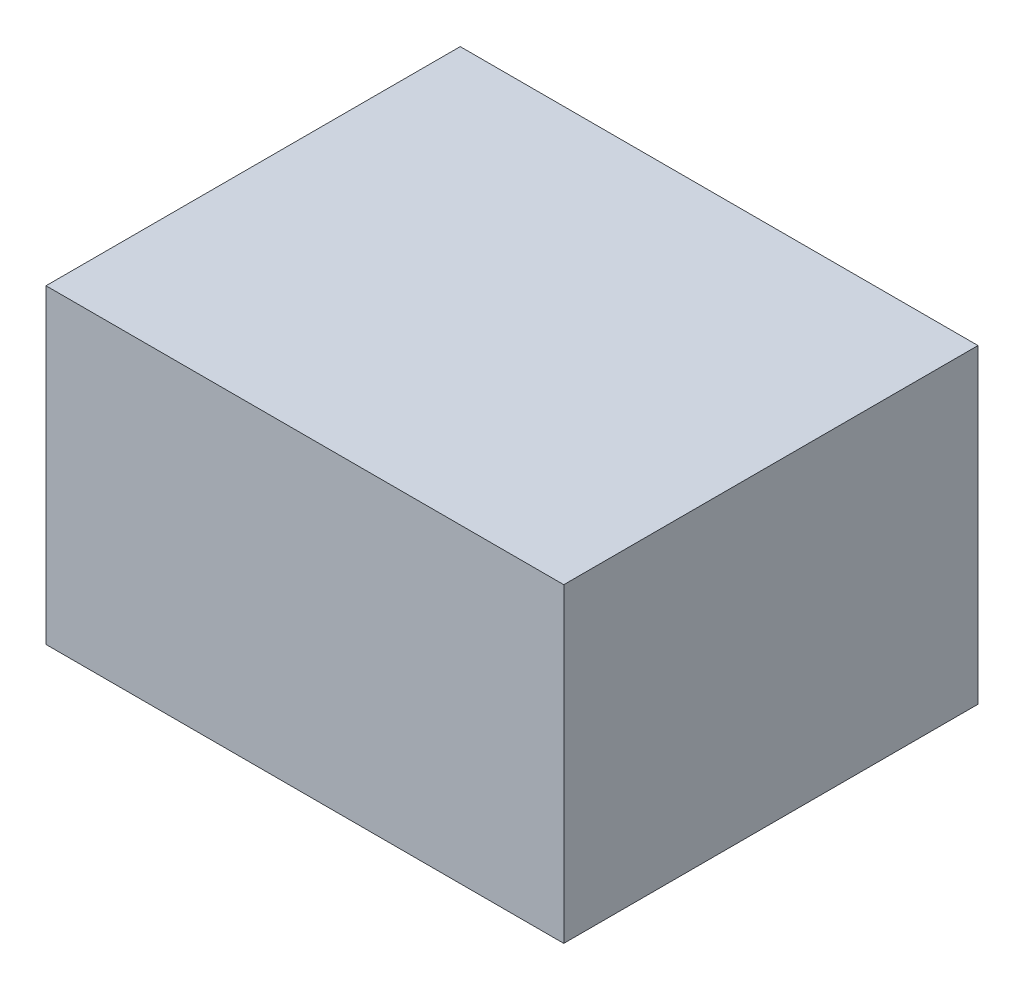
ISO-10303-21;
HEADER;
FILE_DESCRIPTION(('STEP AP214'),'2;1');
FILE_NAME('part.step','',(''),(''),'','','');
FILE_SCHEMA(('AUTOMOTIVE_DESIGN { 1 0 10303 214 1 1 1 1 }'));
ENDSEC;
DATA;
#1=APPLICATION_CONTEXT('core data for automotive mechanical design processes');
#2=APPLICATION_PROTOCOL_DEFINITION('international standard','automotive_design',2000,#1);
#3=PRODUCT_CONTEXT('',#1,'mechanical');
#4=PRODUCT('Part','Part','',(#3));
#5=PRODUCT_RELATED_PRODUCT_CATEGORY('part','',(#4));
#6=PRODUCT_DEFINITION_FORMATION('','',#4);
#7=PRODUCT_DEFINITION_CONTEXT('part definition',#1,'design');
#8=PRODUCT_DEFINITION('design','',#6,#7);
#9=PRODUCT_DEFINITION_SHAPE('','',#8);
#10=(LENGTH_UNIT() NAMED_UNIT(*) SI_UNIT(.MILLI.,.METRE.));
#11=(NAMED_UNIT(*) PLANE_ANGLE_UNIT() SI_UNIT($,.RADIAN.));
#12=(NAMED_UNIT(*) SI_UNIT($,.STERADIAN.) SOLID_ANGLE_UNIT());
#13=UNCERTAINTY_MEASURE_WITH_UNIT(LENGTH_MEASURE(1.E-05),#10,'distance_accuracy_value','');
#14=(GEOMETRIC_REPRESENTATION_CONTEXT(3) GLOBAL_UNCERTAINTY_ASSIGNED_CONTEXT((#13)) GLOBAL_UNIT_ASSIGNED_CONTEXT((#10,
#11,#12)) REPRESENTATION_CONTEXT('',''));
#15=CARTESIAN_POINT('',(0.,0.,0.));
#16=DIRECTION('',(0.,0.,1.));
#17=DIRECTION('',(1.,0.,0.));
#18=AXIS2_PLACEMENT_3D('',#15,#16,#17);
#19=CARTESIAN_POINT('',(127.,152.4,101.6));
#20=DIRECTION('',(-1.,0.,0.));
#21=DIRECTION('',(0.,0.,1.));
#22=AXIS2_PLACEMENT_3D('',#19,#20,#21);
#23=PLANE('',#22);
#24=DIRECTION('',(0.,0.,-1.));
#25=VECTOR('',#24,1.);
#26=CARTESIAN_POINT('',(127.,0.,101.6));
#27=LINE('',#26,#25);
#28=CARTESIAN_POINT('',(127.,0.,101.6));
#29=VERTEX_POINT('',#28);
#30=CARTESIAN_POINT('',(127.,0.,-101.6));
#31=VERTEX_POINT('',#30);
#32=EDGE_CURVE('E111',#29,#31,#27,.T.);
#33=ORIENTED_EDGE('',*,*,#32,.T.);
#34=DIRECTION('',(0.,-1.,0.));
#35=VECTOR('',#34,1.);
#36=CARTESIAN_POINT('',(127.,152.4,-101.6));
#37=LINE('',#36,#35);
#38=CARTESIAN_POINT('',(127.,152.4,-101.6));
#39=VERTEX_POINT('',#38);
#40=EDGE_CURVE('E11',#39,#31,#37,.T.);
#41=ORIENTED_EDGE('',*,*,#40,.F.);
#42=DIRECTION('',(0.,0.,-1.));
#43=VECTOR('',#42,1.);
#44=CARTESIAN_POINT('',(127.,152.4,101.6));
#45=LINE('',#44,#43);
#46=CARTESIAN_POINT('',(127.,152.4,101.6));
#47=VERTEX_POINT('',#46);
#48=EDGE_CURVE('E95',#47,#39,#45,.T.);
#49=ORIENTED_EDGE('',*,*,#48,.F.);
#50=DIRECTION('',(0.,-1.,0.));
#51=VECTOR('',#50,1.);
#52=CARTESIAN_POINT('',(127.,152.4,101.6));
#53=LINE('',#52,#51);
#54=EDGE_CURVE('E107',#47,#29,#53,.T.);
#55=ORIENTED_EDGE('',*,*,#54,.T.);
#56=EDGE_LOOP('',(#33,#41,#49,#55));
#57=FACE_BOUND('',#56,.T.);
#58=ADVANCED_FACE('F43',(#57),#23,.F.);
#59=CARTESIAN_POINT('',(-127.,152.4,-101.6));
#60=DIRECTION('',(0.,0.,1.));
#61=DIRECTION('',(1.,0.,0.));
#62=AXIS2_PLACEMENT_3D('',#59,#60,#61);
#63=PLANE('',#62);
#64=DIRECTION('',(-1.,0.,0.));
#65=VECTOR('',#64,1.);
#66=CARTESIAN_POINT('',(-127.,0.,-101.6));
#67=LINE('',#66,#65);
#68=CARTESIAN_POINT('',(-127.,0.,-101.6));
#69=VERTEX_POINT('',#68);
#70=EDGE_CURVE('E100',#31,#69,#67,.T.);
#71=ORIENTED_EDGE('',*,*,#70,.T.);
#72=DIRECTION('',(0.,-1.,0.));
#73=VECTOR('',#72,1.);
#74=CARTESIAN_POINT('',(-127.,152.4,-101.6));
#75=LINE('',#74,#73);
#76=CARTESIAN_POINT('',(-127.,152.4,-101.6));
#77=VERTEX_POINT('',#76);
#78=EDGE_CURVE('E52',#77,#69,#75,.T.);
#79=ORIENTED_EDGE('',*,*,#78,.F.);
#80=DIRECTION('',(-1.,0.,0.));
#81=VECTOR('',#80,1.);
#82=CARTESIAN_POINT('',(-127.,152.4,-101.6));
#83=LINE('',#82,#81);
#84=EDGE_CURVE('E90',#39,#77,#83,.T.);
#85=ORIENTED_EDGE('',*,*,#84,.F.);
#86=ORIENTED_EDGE('',*,*,#40,.T.);
#87=EDGE_LOOP('',(#71,#79,#85,#86));
#88=FACE_BOUND('',#87,.T.);
#89=ADVANCED_FACE('F99',(#88),#63,.F.);
#90=CARTESIAN_POINT('',(-127.,152.4,101.6));
#91=DIRECTION('',(1.,0.,0.));
#92=DIRECTION('',(0.,0.,-1.));
#93=AXIS2_PLACEMENT_3D('',#90,#91,#92);
#94=PLANE('',#93);
#95=DIRECTION('',(0.,0.,1.));
#96=VECTOR('',#95,1.);
#97=CARTESIAN_POINT('',(-127.,0.,101.6));
#98=LINE('',#97,#96);
#99=CARTESIAN_POINT('',(-127.,0.,101.6));
#100=VERTEX_POINT('',#99);
#101=EDGE_CURVE('E77',#69,#100,#98,.T.);
#102=ORIENTED_EDGE('',*,*,#101,.T.);
#103=DIRECTION('',(0.,-1.,0.));
#104=VECTOR('',#103,1.);
#105=CARTESIAN_POINT('',(-127.,152.4,101.6));
#106=LINE('',#105,#104);
#107=CARTESIAN_POINT('',(-127.,152.4,101.6));
#108=VERTEX_POINT('',#107);
#109=EDGE_CURVE('E102',#108,#100,#106,.T.);
#110=ORIENTED_EDGE('',*,*,#109,.F.);
#111=DIRECTION('',(0.,0.,1.));
#112=VECTOR('',#111,1.);
#113=CARTESIAN_POINT('',(-127.,152.4,101.6));
#114=LINE('',#113,#112);
#115=EDGE_CURVE('E93',#77,#108,#114,.T.);
#116=ORIENTED_EDGE('',*,*,#115,.F.);
#117=ORIENTED_EDGE('',*,*,#78,.T.);
#118=EDGE_LOOP('',(#102,#110,#116,#117));
#119=FACE_BOUND('',#118,.T.);
#120=ADVANCED_FACE('F103',(#119),#94,.F.);
#121=CARTESIAN_POINT('',(-127.,152.4,101.6));
#122=DIRECTION('',(0.,0.,-1.));
#123=DIRECTION('',(-1.,0.,0.));
#124=AXIS2_PLACEMENT_3D('',#121,#122,#123);
#125=PLANE('',#124);
#126=DIRECTION('',(1.,0.,0.));
#127=VECTOR('',#126,1.);
#128=CARTESIAN_POINT('',(-127.,0.,101.6));
#129=LINE('',#128,#127);
#130=EDGE_CURVE('E83',#100,#29,#129,.T.);
#131=ORIENTED_EDGE('',*,*,#130,.T.);
#132=ORIENTED_EDGE('',*,*,#54,.F.);
#133=DIRECTION('',(1.,0.,0.));
#134=VECTOR('',#133,1.);
#135=CARTESIAN_POINT('',(-127.,152.4,101.6));
#136=LINE('',#135,#134);
#137=EDGE_CURVE('E60',#108,#47,#136,.T.);
#138=ORIENTED_EDGE('',*,*,#137,.F.);
#139=ORIENTED_EDGE('',*,*,#109,.T.);
#140=EDGE_LOOP('',(#131,#132,#138,#139));
#141=FACE_BOUND('',#140,.T.);
#142=ADVANCED_FACE('F124',(#141),#125,.F.);
#143=CARTESIAN_POINT('',(0.,152.4,0.));
#144=DIRECTION('',(0.,-1.,0.));
#145=DIRECTION('',(0.,0.,-1.));
#146=AXIS2_PLACEMENT_3D('',#143,#144,#145);
#147=PLANE('',#146);
#148=ORIENTED_EDGE('',*,*,#48,.T.);
#149=ORIENTED_EDGE('',*,*,#84,.T.);
#150=ORIENTED_EDGE('',*,*,#115,.T.);
#151=ORIENTED_EDGE('',*,*,#137,.T.);
#152=EDGE_LOOP('',(#148,#149,#150,#151));
#153=FACE_BOUND('',#152,.T.);
#154=ADVANCED_FACE('F91',(#153),#147,.F.);
#155=CARTESIAN_POINT('',(0.,0.,0.));
#156=DIRECTION('',(0.,-1.,0.));
#157=DIRECTION('',(0.,0.,-1.));
#158=AXIS2_PLACEMENT_3D('',#155,#156,#157);
#159=PLANE('',#158);
#160=ORIENTED_EDGE('',*,*,#32,.F.);
#161=ORIENTED_EDGE('',*,*,#130,.F.);
#162=ORIENTED_EDGE('',*,*,#101,.F.);
#163=ORIENTED_EDGE('',*,*,#70,.F.);
#164=EDGE_LOOP('',(#160,#161,#162,#163));
#165=FACE_BOUND('',#164,.T.);
#166=ADVANCED_FACE('F127',(#165),#159,.T.);
#167=CLOSED_SHELL('',(#58,#89,#120,#142,#154,#166));
#168=MANIFOLD_SOLID_BREP('B2',#167);
#169=ADVANCED_BREP_SHAPE_REPRESENTATION('',(#18,#168),#14);
#170=SHAPE_DEFINITION_REPRESENTATION(#9,#169);
ENDSEC;
END-ISO-10303-21;
